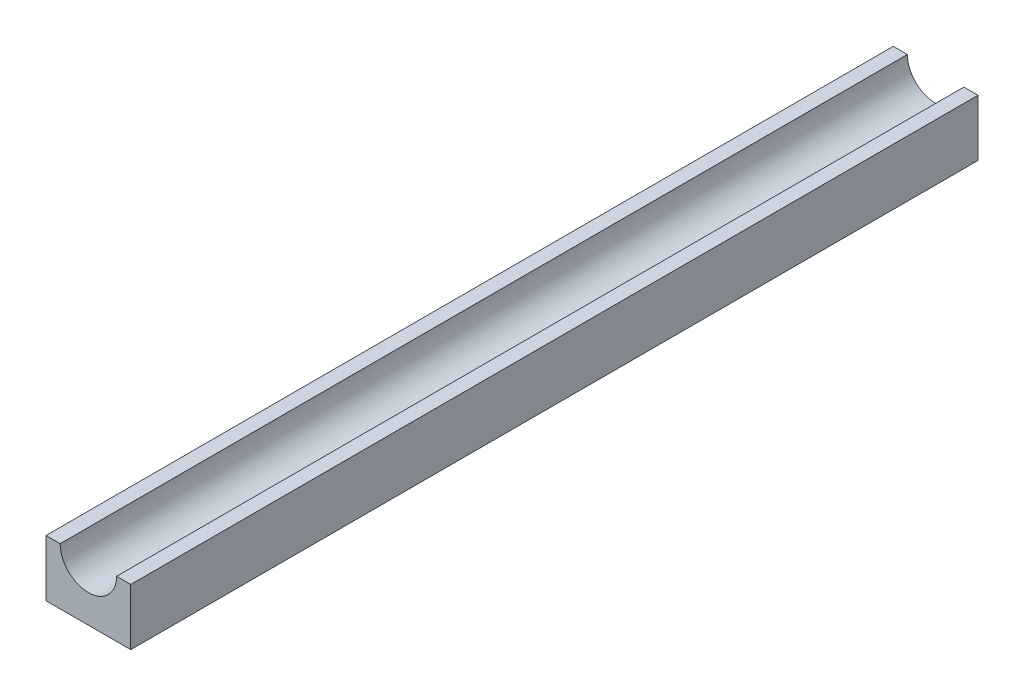
ISO-10303-21;
HEADER;
FILE_DESCRIPTION(('STEP AP214'),'2;1');
FILE_NAME('part.step','',(''),(''),'','','');
FILE_SCHEMA(('AUTOMOTIVE_DESIGN { 1 0 10303 214 1 1 1 1 }'));
ENDSEC;
DATA;
#1=APPLICATION_CONTEXT('core data for automotive mechanical design processes');
#2=APPLICATION_PROTOCOL_DEFINITION('international standard','automotive_design',2000,#1);
#3=PRODUCT_CONTEXT('',#1,'mechanical');
#4=PRODUCT('Part','Part','',(#3));
#5=PRODUCT_RELATED_PRODUCT_CATEGORY('part','',(#4));
#6=PRODUCT_DEFINITION_FORMATION('','',#4);
#7=PRODUCT_DEFINITION_CONTEXT('part definition',#1,'design');
#8=PRODUCT_DEFINITION('design','',#6,#7);
#9=PRODUCT_DEFINITION_SHAPE('','',#8);
#10=(LENGTH_UNIT() NAMED_UNIT(*) SI_UNIT(.MILLI.,.METRE.));
#11=(NAMED_UNIT(*) PLANE_ANGLE_UNIT() SI_UNIT($,.RADIAN.));
#12=(NAMED_UNIT(*) SI_UNIT($,.STERADIAN.) SOLID_ANGLE_UNIT());
#13=UNCERTAINTY_MEASURE_WITH_UNIT(LENGTH_MEASURE(1.E-05),#10,'distance_accuracy_value','');
#14=(GEOMETRIC_REPRESENTATION_CONTEXT(3) GLOBAL_UNCERTAINTY_ASSIGNED_CONTEXT((#13)) GLOBAL_UNIT_ASSIGNED_CONTEXT((#10,
#11,#12)) REPRESENTATION_CONTEXT('',''));
#15=CARTESIAN_POINT('',(0.,0.,0.));
#16=DIRECTION('',(0.,0.,1.));
#17=DIRECTION('',(1.,0.,0.));
#18=AXIS2_PLACEMENT_3D('',#15,#16,#17);
#19=CARTESIAN_POINT('',(0.,5.,150.));
#20=DIRECTION('',(0.,0.,-1.));
#21=DIRECTION('',(-1.,0.,0.));
#22=AXIS2_PLACEMENT_3D('',#19,#20,#21);
#23=CYLINDRICAL_SURFACE('',#22,5.);
#24=CARTESIAN_POINT('',(0.,5.,0.));
#25=DIRECTION('',(0.,0.,1.));
#26=DIRECTION('',(1.,0.,0.));
#27=AXIS2_PLACEMENT_3D('',#24,#25,#26);
#28=CIRCLE('',#27,5.);
#29=CARTESIAN_POINT('',(-5.,5.,0.));
#30=VERTEX_POINT('',#29);
#31=CARTESIAN_POINT('',(5.,5.,0.));
#32=VERTEX_POINT('',#31);
#33=EDGE_CURVE('E207',#30,#32,#28,.T.);
#34=ORIENTED_EDGE('',*,*,#33,.F.);
#35=DIRECTION('',(0.,0.,-1.));
#36=VECTOR('',#35,1.);
#37=CARTESIAN_POINT('',(-5.,5.,150.));
#38=LINE('',#37,#36);
#39=CARTESIAN_POINT('',(-5.,5.,150.));
#40=VERTEX_POINT('',#39);
#41=EDGE_CURVE('E11',#40,#30,#38,.T.);
#42=ORIENTED_EDGE('',*,*,#41,.F.);
#43=CARTESIAN_POINT('',(0.,5.,150.));
#44=DIRECTION('',(0.,0.,1.));
#45=DIRECTION('',(1.,0.,0.));
#46=AXIS2_PLACEMENT_3D('',#43,#44,#45);
#47=CIRCLE('',#46,5.);
#48=CARTESIAN_POINT('',(5.,5.,150.));
#49=VERTEX_POINT('',#48);
#50=EDGE_CURVE('E208',#40,#49,#47,.T.);
#51=ORIENTED_EDGE('',*,*,#50,.T.);
#52=DIRECTION('',(0.,0.,-1.));
#53=VECTOR('',#52,1.);
#54=CARTESIAN_POINT('',(5.,5.,150.));
#55=LINE('',#54,#53);
#56=EDGE_CURVE('E236',#49,#32,#55,.T.);
#57=ORIENTED_EDGE('',*,*,#56,.T.);
#58=EDGE_LOOP('',(#34,#42,#51,#57));
#59=FACE_BOUND('',#58,.T.);
#60=ADVANCED_FACE('F39',(#59),#23,.F.);
#61=CARTESIAN_POINT('',(0.,5.,150.));
#62=DIRECTION('',(0.,1.,0.));
#63=DIRECTION('',(0.,0.,1.));
#64=AXIS2_PLACEMENT_3D('',#61,#62,#63);
#65=PLANE('',#64);
#66=DIRECTION('',(1.,0.,0.));
#67=VECTOR('',#66,1.);
#68=CARTESIAN_POINT('',(0.,5.,0.));
#69=LINE('',#68,#67);
#70=CARTESIAN_POINT('',(-7.5,5.,0.));
#71=VERTEX_POINT('',#70);
#72=EDGE_CURVE('E225',#71,#30,#69,.T.);
#73=ORIENTED_EDGE('',*,*,#72,.F.);
#74=DIRECTION('',(0.,0.,-1.));
#75=VECTOR('',#74,1.);
#76=CARTESIAN_POINT('',(-7.5,5.,150.));
#77=LINE('',#76,#75);
#78=CARTESIAN_POINT('',(-7.5,5.,150.));
#79=VERTEX_POINT('',#78);
#80=EDGE_CURVE('E47',#79,#71,#77,.T.);
#81=ORIENTED_EDGE('',*,*,#80,.F.);
#82=DIRECTION('',(1.,0.,0.));
#83=VECTOR('',#82,1.);
#84=CARTESIAN_POINT('',(0.,5.,150.));
#85=LINE('',#84,#83);
#86=EDGE_CURVE('E211',#79,#40,#85,.T.);
#87=ORIENTED_EDGE('',*,*,#86,.T.);
#88=ORIENTED_EDGE('',*,*,#41,.T.);
#89=EDGE_LOOP('',(#73,#81,#87,#88));
#90=FACE_BOUND('',#89,.T.);
#91=ADVANCED_FACE('F282',(#90),#65,.T.);
#92=CARTESIAN_POINT('',(-7.5,0.,150.));
#93=DIRECTION('',(1.,0.,0.));
#94=DIRECTION('',(0.,1.,0.));
#95=AXIS2_PLACEMENT_3D('',#92,#93,#94);
#96=PLANE('',#95);
#97=DIRECTION('',(0.,-1.,0.));
#98=VECTOR('',#97,1.);
#99=CARTESIAN_POINT('',(-7.5,0.,0.));
#100=LINE('',#99,#98);
#101=CARTESIAN_POINT('',(-7.5,-5.,0.));
#102=VERTEX_POINT('',#101);
#103=EDGE_CURVE('E228',#71,#102,#100,.T.);
#104=ORIENTED_EDGE('',*,*,#103,.T.);
#105=DIRECTION('',(0.,0.,-1.));
#106=VECTOR('',#105,1.);
#107=CARTESIAN_POINT('',(-7.5,-5.,150.));
#108=LINE('',#107,#106);
#109=CARTESIAN_POINT('',(-7.5,-5.,150.));
#110=VERTEX_POINT('',#109);
#111=EDGE_CURVE('E242',#110,#102,#108,.T.);
#112=ORIENTED_EDGE('',*,*,#111,.F.);
#113=DIRECTION('',(0.,-1.,0.));
#114=VECTOR('',#113,1.);
#115=CARTESIAN_POINT('',(-7.5,0.,150.));
#116=LINE('',#115,#114);
#117=EDGE_CURVE('E215',#79,#110,#116,.T.);
#118=ORIENTED_EDGE('',*,*,#117,.F.);
#119=ORIENTED_EDGE('',*,*,#80,.T.);
#120=EDGE_LOOP('',(#104,#112,#118,#119));
#121=FACE_BOUND('',#120,.T.);
#122=ADVANCED_FACE('F287',(#121),#96,.F.);
#123=CARTESIAN_POINT('',(0.,-5.,150.));
#124=DIRECTION('',(0.,1.,0.));
#125=DIRECTION('',(0.,0.,1.));
#126=AXIS2_PLACEMENT_3D('',#123,#124,#125);
#127=PLANE('',#126);
#128=DIRECTION('',(1.,0.,0.));
#129=VECTOR('',#128,1.);
#130=CARTESIAN_POINT('',(-1.49999999999999,-5.00000000000002,12.5));
#131=LINE('',#130,#129);
#132=CARTESIAN_POINT('',(-1.49999999999999,-5.,12.5));
#133=VERTEX_POINT('',#132);
#134=CARTESIAN_POINT('',(1.50000000000001,-5.,12.5));
#135=VERTEX_POINT('',#134);
#136=EDGE_CURVE('E60',#133,#135,#131,.T.);
#137=ORIENTED_EDGE('',*,*,#136,.F.);
#138=DIRECTION('',(0.,0.,-1.));
#139=VECTOR('',#138,1.);
#140=CARTESIAN_POINT('',(-1.5,-5.00000000000001,90.));
#141=LINE('',#140,#139);
#142=CARTESIAN_POINT('',(-1.49999999999999,-5.,17.5));
#143=VERTEX_POINT('',#142);
#144=EDGE_CURVE('E55',#143,#133,#141,.T.);
#145=ORIENTED_EDGE('',*,*,#144,.F.);
#146=DIRECTION('',(1.,0.,0.));
#147=VECTOR('',#146,1.);
#148=CARTESIAN_POINT('',(-1.49999999999999,-5.00000000000002,17.5));
#149=LINE('',#148,#147);
#150=CARTESIAN_POINT('',(1.50000000000001,-5.00000000000002,17.5));
#151=VERTEX_POINT('',#150);
#152=EDGE_CURVE('E173',#143,#151,#149,.T.);
#153=ORIENTED_EDGE('',*,*,#152,.T.);
#154=DIRECTION('',(0.,0.,-1.));
#155=VECTOR('',#154,1.);
#156=CARTESIAN_POINT('',(1.5,-5.00000000000001,90.));
#157=LINE('',#156,#155);
#158=EDGE_CURVE('E165',#151,#135,#157,.T.);
#159=ORIENTED_EDGE('',*,*,#158,.T.);
#160=EDGE_LOOP('',(#137,#145,#153,#159));
#161=FACE_BOUND('',#160,.T.);
#162=DIRECTION('',(1.,0.,0.));
#163=VECTOR('',#162,1.);
#164=CARTESIAN_POINT('',(-1.49999999999999,-5.00000000000002,72.5));
#165=LINE('',#164,#163);
#166=CARTESIAN_POINT('',(-1.49999999999999,-5.,72.5));
#167=VERTEX_POINT('',#166);
#168=CARTESIAN_POINT('',(1.50000000000001,-5.,72.5));
#169=VERTEX_POINT('',#168);
#170=EDGE_CURVE('E187',#167,#169,#165,.T.);
#171=ORIENTED_EDGE('',*,*,#170,.F.);
#172=DIRECTION('',(0.,0.,1.));
#173=VECTOR('',#172,1.);
#174=CARTESIAN_POINT('',(-1.5,-5.00000000000001,0.));
#175=LINE('',#174,#173);
#176=CARTESIAN_POINT('',(-1.49999999999999,-5.,77.5));
#177=VERTEX_POINT('',#176);
#178=EDGE_CURVE('E185',#167,#177,#175,.T.);
#179=ORIENTED_EDGE('',*,*,#178,.T.);
#180=DIRECTION('',(1.,0.,0.));
#181=VECTOR('',#180,1.);
#182=CARTESIAN_POINT('',(-1.49999999999999,-5.00000000000002,77.5));
#183=LINE('',#182,#181);
#184=CARTESIAN_POINT('',(1.50000000000001,-5.00000000000002,77.5));
#185=VERTEX_POINT('',#184);
#186=EDGE_CURVE('E200',#177,#185,#183,.T.);
#187=ORIENTED_EDGE('',*,*,#186,.T.);
#188=DIRECTION('',(0.,0.,1.));
#189=VECTOR('',#188,1.);
#190=CARTESIAN_POINT('',(1.5,-5.00000000000001,0.));
#191=LINE('',#190,#189);
#192=EDGE_CURVE('E180',#169,#185,#191,.T.);
#193=ORIENTED_EDGE('',*,*,#192,.F.);
#194=EDGE_LOOP('',(#171,#179,#187,#193));
#195=FACE_BOUND('',#194,.T.);
#196=DIRECTION('',(1.,0.,0.));
#197=VECTOR('',#196,1.);
#198=CARTESIAN_POINT('',(0.,-5.,0.));
#199=LINE('',#198,#197);
#200=CARTESIAN_POINT('',(7.5,-5.,0.));
#201=VERTEX_POINT('',#200);
#202=EDGE_CURVE('E230',#102,#201,#199,.T.);
#203=ORIENTED_EDGE('',*,*,#202,.T.);
#204=DIRECTION('',(0.,0.,-1.));
#205=VECTOR('',#204,1.);
#206=CARTESIAN_POINT('',(7.5,-5.,150.));
#207=LINE('',#206,#205);
#208=CARTESIAN_POINT('',(7.5,-5.,150.));
#209=VERTEX_POINT('',#208);
#210=EDGE_CURVE('E240',#209,#201,#207,.T.);
#211=ORIENTED_EDGE('',*,*,#210,.F.);
#212=DIRECTION('',(1.,0.,0.));
#213=VECTOR('',#212,1.);
#214=CARTESIAN_POINT('',(0.,-5.,150.));
#215=LINE('',#214,#213);
#216=EDGE_CURVE('E218',#110,#209,#215,.T.);
#217=ORIENTED_EDGE('',*,*,#216,.F.);
#218=ORIENTED_EDGE('',*,*,#111,.T.);
#219=EDGE_LOOP('',(#203,#211,#217,#218));
#220=FACE_BOUND('',#219,.T.);
#221=ADVANCED_FACE('F264',(#161,#195,#220),#127,.F.);
#222=CARTESIAN_POINT('',(7.5,0.,150.));
#223=DIRECTION('',(1.,0.,0.));
#224=DIRECTION('',(0.,1.,0.));
#225=AXIS2_PLACEMENT_3D('',#222,#223,#224);
#226=PLANE('',#225);
#227=DIRECTION('',(0.,-1.,0.));
#228=VECTOR('',#227,1.);
#229=CARTESIAN_POINT('',(7.5,0.,0.));
#230=LINE('',#229,#228);
#231=CARTESIAN_POINT('',(7.5,5.,0.));
#232=VERTEX_POINT('',#231);
#233=EDGE_CURVE('E233',#232,#201,#230,.T.);
#234=ORIENTED_EDGE('',*,*,#233,.F.);
#235=DIRECTION('',(0.,0.,-1.));
#236=VECTOR('',#235,1.);
#237=CARTESIAN_POINT('',(7.5,5.,150.));
#238=LINE('',#237,#236);
#239=CARTESIAN_POINT('',(7.5,5.,150.));
#240=VERTEX_POINT('',#239);
#241=EDGE_CURVE('E238',#240,#232,#238,.T.);
#242=ORIENTED_EDGE('',*,*,#241,.F.);
#243=DIRECTION('',(0.,-1.,0.));
#244=VECTOR('',#243,1.);
#245=CARTESIAN_POINT('',(7.5,0.,150.));
#246=LINE('',#245,#244);
#247=EDGE_CURVE('E220',#240,#209,#246,.T.);
#248=ORIENTED_EDGE('',*,*,#247,.T.);
#249=ORIENTED_EDGE('',*,*,#210,.T.);
#250=EDGE_LOOP('',(#234,#242,#248,#249));
#251=FACE_BOUND('',#250,.T.);
#252=ADVANCED_FACE('F311',(#251),#226,.T.);
#253=EDGE_CURVE('E212',#32,#232,#69,.T.);
#254=ORIENTED_EDGE('',*,*,#253,.F.);
#255=ORIENTED_EDGE('',*,*,#56,.F.);
#256=EDGE_CURVE('E216',#49,#240,#85,.T.);
#257=ORIENTED_EDGE('',*,*,#256,.T.);
#258=ORIENTED_EDGE('',*,*,#241,.T.);
#259=EDGE_LOOP('',(#254,#255,#257,#258));
#260=FACE_BOUND('',#259,.T.);
#261=ADVANCED_FACE('F290',(#260),#65,.T.);
#262=CARTESIAN_POINT('',(0.,0.,150.));
#263=DIRECTION('',(0.,0.,1.));
#264=DIRECTION('',(1.,0.,0.));
#265=AXIS2_PLACEMENT_3D('',#262,#263,#264);
#266=PLANE('',#265);
#267=ORIENTED_EDGE('',*,*,#50,.F.);
#268=ORIENTED_EDGE('',*,*,#86,.F.);
#269=ORIENTED_EDGE('',*,*,#117,.T.);
#270=ORIENTED_EDGE('',*,*,#216,.T.);
#271=ORIENTED_EDGE('',*,*,#247,.F.);
#272=ORIENTED_EDGE('',*,*,#256,.F.);
#273=EDGE_LOOP('',(#267,#268,#269,#270,#271,#272));
#274=FACE_BOUND('',#273,.T.);
#275=ADVANCED_FACE('F303',(#274),#266,.T.);
#276=CARTESIAN_POINT('',(0.,0.,0.));
#277=DIRECTION('',(0.,0.,1.));
#278=DIRECTION('',(1.,0.,0.));
#279=AXIS2_PLACEMENT_3D('',#276,#277,#278);
#280=PLANE('',#279);
#281=ORIENTED_EDGE('',*,*,#33,.T.);
#282=ORIENTED_EDGE('',*,*,#253,.T.);
#283=ORIENTED_EDGE('',*,*,#233,.T.);
#284=ORIENTED_EDGE('',*,*,#202,.F.);
#285=ORIENTED_EDGE('',*,*,#103,.F.);
#286=ORIENTED_EDGE('',*,*,#72,.T.);
#287=EDGE_LOOP('',(#281,#282,#283,#284,#285,#286));
#288=FACE_BOUND('',#287,.T.);
#289=ADVANCED_FACE('F298',(#288),#280,.F.);
#290=CARTESIAN_POINT('',(-1.5,0.,72.5));
#291=DIRECTION('',(0.,0.,1.));
#292=DIRECTION('',(1.,0.,0.));
#293=AXIS2_PLACEMENT_3D('',#290,#291,#292);
#294=PLANE('',#293);
#295=DIRECTION('',(0.,-1.,0.));
#296=VECTOR('',#295,1.);
#297=CARTESIAN_POINT('',(1.5,0.,72.5));
#298=LINE('',#297,#296);
#299=CARTESIAN_POINT('',(1.50000000000001,-8.00000000000001,72.5));
#300=VERTEX_POINT('',#299);
#301=EDGE_CURVE('E175',#169,#300,#298,.T.);
#302=ORIENTED_EDGE('',*,*,#301,.T.);
#303=DIRECTION('',(1.,0.,0.));
#304=VECTOR('',#303,1.);
#305=CARTESIAN_POINT('',(-1.49999999999999,-8.00000000000001,72.5));
#306=LINE('',#305,#304);
#307=CARTESIAN_POINT('',(-1.49999999999999,-8.00000000000001,72.5));
#308=VERTEX_POINT('',#307);
#309=EDGE_CURVE('E204',#308,#300,#306,.T.);
#310=ORIENTED_EDGE('',*,*,#309,.F.);
#311=DIRECTION('',(0.,-1.,0.));
#312=VECTOR('',#311,1.);
#313=CARTESIAN_POINT('',(-1.5,0.,72.5));
#314=LINE('',#313,#312);
#315=EDGE_CURVE('E176',#167,#308,#314,.T.);
#316=ORIENTED_EDGE('',*,*,#315,.F.);
#317=ORIENTED_EDGE('',*,*,#170,.T.);
#318=EDGE_LOOP('',(#302,#310,#316,#317));
#319=FACE_BOUND('',#318,.T.);
#320=ADVANCED_FACE('F327',(#319),#294,.F.);
#321=CARTESIAN_POINT('',(-1.49999999999999,-8.00000000000001,75.));
#322=DIRECTION('',(1.,0.,0.));
#323=DIRECTION('',(0.,1.,0.));
#324=AXIS2_PLACEMENT_3D('',#321,#322,#323);
#325=CYLINDRICAL_SURFACE('',#324,2.50000000000001);
#326=CARTESIAN_POINT('',(1.50000000000001,-8.00000000000001,75.));
#327=DIRECTION('',(-1.,0.,0.));
#328=DIRECTION('',(0.,-1.,0.));
#329=AXIS2_PLACEMENT_3D('',#326,#327,#328);
#330=CIRCLE('',#329,2.50000000000001);
#331=CARTESIAN_POINT('',(1.50000000000001,-8.00000000000001,77.5));
#332=VERTEX_POINT('',#331);
#333=EDGE_CURVE('E190',#300,#332,#330,.T.);
#334=ORIENTED_EDGE('',*,*,#333,.T.);
#335=DIRECTION('',(1.,0.,0.));
#336=VECTOR('',#335,1.);
#337=CARTESIAN_POINT('',(-1.49999999999999,-8.00000000000001,77.5));
#338=LINE('',#337,#336);
#339=CARTESIAN_POINT('',(-1.49999999999999,-8.00000000000001,77.5));
#340=VERTEX_POINT('',#339);
#341=EDGE_CURVE('E202',#340,#332,#338,.T.);
#342=ORIENTED_EDGE('',*,*,#341,.F.);
#343=CARTESIAN_POINT('',(-1.49999999999999,-8.00000000000001,75.));
#344=DIRECTION('',(-1.,0.,0.));
#345=DIRECTION('',(0.,-1.,0.));
#346=AXIS2_PLACEMENT_3D('',#343,#344,#345);
#347=CIRCLE('',#346,2.50000000000001);
#348=EDGE_CURVE('E179',#308,#340,#347,.T.);
#349=ORIENTED_EDGE('',*,*,#348,.F.);
#350=ORIENTED_EDGE('',*,*,#309,.T.);
#351=EDGE_LOOP('',(#334,#342,#349,#350));
#352=FACE_BOUND('',#351,.T.);
#353=ADVANCED_FACE('F332',(#352),#325,.T.);
#354=CARTESIAN_POINT('',(-1.5,0.,77.5));
#355=DIRECTION('',(0.,0.,1.));
#356=DIRECTION('',(1.,0.,0.));
#357=AXIS2_PLACEMENT_3D('',#354,#355,#356);
#358=PLANE('',#357);
#359=DIRECTION('',(0.,-1.,0.));
#360=VECTOR('',#359,1.);
#361=CARTESIAN_POINT('',(1.5,0.,77.5));
#362=LINE('',#361,#360);
#363=EDGE_CURVE('E193',#185,#332,#362,.T.);
#364=ORIENTED_EDGE('',*,*,#363,.F.);
#365=ORIENTED_EDGE('',*,*,#186,.F.);
#366=DIRECTION('',(0.,-1.,0.));
#367=VECTOR('',#366,1.);
#368=CARTESIAN_POINT('',(-1.5,0.,77.5));
#369=LINE('',#368,#367);
#370=EDGE_CURVE('E182',#177,#340,#369,.T.);
#371=ORIENTED_EDGE('',*,*,#370,.T.);
#372=ORIENTED_EDGE('',*,*,#341,.T.);
#373=EDGE_LOOP('',(#364,#365,#371,#372));
#374=FACE_BOUND('',#373,.T.);
#375=ADVANCED_FACE('F336',(#374),#358,.T.);
#376=CARTESIAN_POINT('',(-1.5,0.,0.));
#377=DIRECTION('',(-1.,0.,0.));
#378=DIRECTION('',(0.,-1.,0.));
#379=AXIS2_PLACEMENT_3D('',#376,#377,#378);
#380=PLANE('',#379);
#381=CARTESIAN_POINT('',(-1.49999999999999,-8.00000000000001,75.));
#382=DIRECTION('',(-1.,0.,0.));
#383=DIRECTION('',(0.,-1.,0.));
#384=AXIS2_PLACEMENT_3D('',#381,#382,#383);
#385=CIRCLE('',#384,0.499999999999999);
#386=CARTESIAN_POINT('',(-1.49999999999999,-8.50000000000001,75.));
#387=VERTEX_POINT('',#386);
#388=EDGE_CURVE('E166',#387,#387,#385,.T.);
#389=ORIENTED_EDGE('',*,*,#388,.F.);
#390=EDGE_LOOP('',(#389));
#391=FACE_BOUND('',#390,.T.);
#392=ORIENTED_EDGE('',*,*,#315,.T.);
#393=ORIENTED_EDGE('',*,*,#348,.T.);
#394=ORIENTED_EDGE('',*,*,#370,.F.);
#395=ORIENTED_EDGE('',*,*,#178,.F.);
#396=EDGE_LOOP('',(#392,#393,#394,#395));
#397=FACE_BOUND('',#396,.T.);
#398=ADVANCED_FACE('F340',(#391,#397),#380,.T.);
#399=CARTESIAN_POINT('',(1.5,0.,0.));
#400=DIRECTION('',(-1.,0.,0.));
#401=DIRECTION('',(0.,-1.,0.));
#402=AXIS2_PLACEMENT_3D('',#399,#400,#401);
#403=PLANE('',#402);
#404=CARTESIAN_POINT('',(1.50000000000001,-8.00000000000001,75.));
#405=DIRECTION('',(-1.,0.,0.));
#406=DIRECTION('',(0.,-1.,0.));
#407=AXIS2_PLACEMENT_3D('',#404,#405,#406);
#408=CIRCLE('',#407,0.499999999999999);
#409=CARTESIAN_POINT('',(1.50000000000001,-8.50000000000001,75.));
#410=VERTEX_POINT('',#409);
#411=EDGE_CURVE('E245',#410,#410,#408,.T.);
#412=ORIENTED_EDGE('',*,*,#411,.T.);
#413=EDGE_LOOP('',(#412));
#414=FACE_BOUND('',#413,.T.);
#415=ORIENTED_EDGE('',*,*,#301,.F.);
#416=ORIENTED_EDGE('',*,*,#192,.T.);
#417=ORIENTED_EDGE('',*,*,#363,.T.);
#418=ORIENTED_EDGE('',*,*,#333,.F.);
#419=EDGE_LOOP('',(#415,#416,#417,#418));
#420=FACE_BOUND('',#419,.T.);
#421=ADVANCED_FACE('F342',(#414,#420),#403,.F.);
#422=CARTESIAN_POINT('',(-1.5,0.,17.5));
#423=DIRECTION('',(0.,0.,1.));
#424=DIRECTION('',(1.,0.,0.));
#425=AXIS2_PLACEMENT_3D('',#422,#423,#424);
#426=PLANE('',#425);
#427=DIRECTION('',(0.,-1.,0.));
#428=VECTOR('',#427,1.);
#429=CARTESIAN_POINT('',(1.5,0.,17.5));
#430=LINE('',#429,#428);
#431=CARTESIAN_POINT('',(1.50000000000001,-8.00000000000001,17.5));
#432=VERTEX_POINT('',#431);
#433=EDGE_CURVE('E162',#151,#432,#430,.T.);
#434=ORIENTED_EDGE('',*,*,#433,.F.);
#435=ORIENTED_EDGE('',*,*,#152,.F.);
#436=DIRECTION('',(0.,-1.,0.));
#437=VECTOR('',#436,1.);
#438=CARTESIAN_POINT('',(-1.5,0.,17.5));
#439=LINE('',#438,#437);
#440=CARTESIAN_POINT('',(-1.49999999999999,-8.00000000000001,17.5));
#441=VERTEX_POINT('',#440);
#442=EDGE_CURVE('E170',#143,#441,#439,.T.);
#443=ORIENTED_EDGE('',*,*,#442,.T.);
#444=DIRECTION('',(1.,0.,0.));
#445=VECTOR('',#444,1.);
#446=CARTESIAN_POINT('',(-1.49999999999999,-8.00000000000001,17.5));
#447=LINE('',#446,#445);
#448=EDGE_CURVE('E154',#441,#432,#447,.T.);
#449=ORIENTED_EDGE('',*,*,#448,.T.);
#450=EDGE_LOOP('',(#434,#435,#443,#449));
#451=FACE_BOUND('',#450,.T.);
#452=ADVANCED_FACE('F262',(#451),#426,.T.);
#453=CARTESIAN_POINT('',(-1.5,0.,12.5));
#454=DIRECTION('',(0.,0.,1.));
#455=DIRECTION('',(1.,0.,0.));
#456=AXIS2_PLACEMENT_3D('',#453,#454,#455);
#457=PLANE('',#456);
#458=DIRECTION('',(0.,-1.,0.));
#459=VECTOR('',#458,1.);
#460=CARTESIAN_POINT('',(1.5,0.,12.5));
#461=LINE('',#460,#459);
#462=CARTESIAN_POINT('',(1.50000000000001,-8.00000000000001,12.5));
#463=VERTEX_POINT('',#462);
#464=EDGE_CURVE('E150',#135,#463,#461,.T.);
#465=ORIENTED_EDGE('',*,*,#464,.T.);
#466=DIRECTION('',(1.,0.,0.));
#467=VECTOR('',#466,1.);
#468=CARTESIAN_POINT('',(-1.49999999999999,-8.00000000000001,12.5));
#469=LINE('',#468,#467);
#470=CARTESIAN_POINT('',(-1.49999999999999,-8.00000000000001,12.5));
#471=VERTEX_POINT('',#470);
#472=EDGE_CURVE('E147',#471,#463,#469,.T.);
#473=ORIENTED_EDGE('',*,*,#472,.F.);
#474=DIRECTION('',(0.,-1.,0.));
#475=VECTOR('',#474,1.);
#476=CARTESIAN_POINT('',(-1.5,0.,12.5));
#477=LINE('',#476,#475);
#478=EDGE_CURVE('E138',#133,#471,#477,.T.);
#479=ORIENTED_EDGE('',*,*,#478,.F.);
#480=ORIENTED_EDGE('',*,*,#136,.T.);
#481=EDGE_LOOP('',(#465,#473,#479,#480));
#482=FACE_BOUND('',#481,.T.);
#483=ADVANCED_FACE('F148',(#482),#457,.F.);
#484=CARTESIAN_POINT('',(-1.49999999999999,-8.00000000000001,15.));
#485=DIRECTION('',(1.,0.,0.));
#486=DIRECTION('',(0.,1.,0.));
#487=AXIS2_PLACEMENT_3D('',#484,#485,#486);
#488=CYLINDRICAL_SURFACE('',#487,2.50000000000001);
#489=CARTESIAN_POINT('',(1.50000000000001,-8.00000000000001,15.));
#490=DIRECTION('',(1.,0.,0.));
#491=DIRECTION('',(0.,-1.,0.));
#492=AXIS2_PLACEMENT_3D('',#489,#490,#491);
#493=CIRCLE('',#492,2.50000000000001);
#494=EDGE_CURVE('E169',#432,#463,#493,.T.);
#495=ORIENTED_EDGE('',*,*,#494,.F.);
#496=ORIENTED_EDGE('',*,*,#448,.F.);
#497=CARTESIAN_POINT('',(-1.49999999999999,-8.00000000000001,15.));
#498=DIRECTION('',(1.,0.,0.));
#499=DIRECTION('',(0.,-1.,0.));
#500=AXIS2_PLACEMENT_3D('',#497,#498,#499);
#501=CIRCLE('',#500,2.50000000000001);
#502=EDGE_CURVE('E143',#441,#471,#501,.T.);
#503=ORIENTED_EDGE('',*,*,#502,.T.);
#504=ORIENTED_EDGE('',*,*,#472,.T.);
#505=EDGE_LOOP('',(#495,#496,#503,#504));
#506=FACE_BOUND('',#505,.T.);
#507=ADVANCED_FACE('F156',(#506),#488,.T.);
#508=CARTESIAN_POINT('',(-1.5,0.,90.));
#509=DIRECTION('',(-1.,0.,0.));
#510=DIRECTION('',(0.,-1.,0.));
#511=AXIS2_PLACEMENT_3D('',#508,#509,#510);
#512=PLANE('',#511);
#513=CARTESIAN_POINT('',(-1.5,-8.,15.));
#514=DIRECTION('',(-1.,0.,0.));
#515=DIRECTION('',(0.,-1.,0.));
#516=AXIS2_PLACEMENT_3D('',#513,#514,#515);
#517=CIRCLE('',#516,0.500000000000001);
#518=CARTESIAN_POINT('',(-1.5,-8.5,15.));
#519=VERTEX_POINT('',#518);
#520=EDGE_CURVE('E252',#519,#519,#517,.T.);
#521=ORIENTED_EDGE('',*,*,#520,.F.);
#522=EDGE_LOOP('',(#521));
#523=FACE_BOUND('',#522,.T.);
#524=ORIENTED_EDGE('',*,*,#442,.F.);
#525=ORIENTED_EDGE('',*,*,#144,.T.);
#526=ORIENTED_EDGE('',*,*,#478,.T.);
#527=ORIENTED_EDGE('',*,*,#502,.F.);
#528=EDGE_LOOP('',(#524,#525,#526,#527));
#529=FACE_BOUND('',#528,.T.);
#530=ADVANCED_FACE('F141',(#523,#529),#512,.T.);
#531=CARTESIAN_POINT('',(1.5,0.,90.));
#532=DIRECTION('',(-1.,0.,0.));
#533=DIRECTION('',(0.,-1.,0.));
#534=AXIS2_PLACEMENT_3D('',#531,#532,#533);
#535=PLANE('',#534);
#536=CARTESIAN_POINT('',(1.50000000000001,-8.,15.));
#537=DIRECTION('',(-1.,0.,0.));
#538=DIRECTION('',(0.,-1.,0.));
#539=AXIS2_PLACEMENT_3D('',#536,#537,#538);
#540=CIRCLE('',#539,0.500000000000001);
#541=CARTESIAN_POINT('',(1.50000000000001,-8.5,15.));
#542=VERTEX_POINT('',#541);
#543=EDGE_CURVE('E42',#542,#542,#540,.T.);
#544=ORIENTED_EDGE('',*,*,#543,.T.);
#545=EDGE_LOOP('',(#544));
#546=FACE_BOUND('',#545,.T.);
#547=ORIENTED_EDGE('',*,*,#433,.T.);
#548=ORIENTED_EDGE('',*,*,#494,.T.);
#549=ORIENTED_EDGE('',*,*,#464,.F.);
#550=ORIENTED_EDGE('',*,*,#158,.F.);
#551=EDGE_LOOP('',(#547,#548,#549,#550));
#552=FACE_BOUND('',#551,.T.);
#553=ADVANCED_FACE('F267',(#546,#552),#535,.F.);
#554=CARTESIAN_POINT('',(7.50000000000001,-8.00000000000001,75.));
#555=DIRECTION('',(-1.,0.,0.));
#556=DIRECTION('',(0.,-1.,0.));
#557=AXIS2_PLACEMENT_3D('',#554,#555,#556);
#558=CYLINDRICAL_SURFACE('',#557,0.499999999999999);
#559=ORIENTED_EDGE('',*,*,#388,.T.);
#560=EDGE_LOOP('',(#559));
#561=FACE_BOUND('',#560,.T.);
#562=ORIENTED_EDGE('',*,*,#411,.F.);
#563=EDGE_LOOP('',(#562));
#564=FACE_BOUND('',#563,.T.);
#565=ADVANCED_FACE('F269',(#561,#564),#558,.F.);
#566=CARTESIAN_POINT('',(8.5,-8.,15.));
#567=DIRECTION('',(-1.,0.,0.));
#568=DIRECTION('',(0.,-1.,0.));
#569=AXIS2_PLACEMENT_3D('',#566,#567,#568);
#570=CYLINDRICAL_SURFACE('',#569,0.500000000000001);
#571=ORIENTED_EDGE('',*,*,#520,.T.);
#572=EDGE_LOOP('',(#571));
#573=FACE_BOUND('',#572,.T.);
#574=ORIENTED_EDGE('',*,*,#543,.F.);
#575=EDGE_LOOP('',(#574));
#576=FACE_BOUND('',#575,.T.);
#577=ADVANCED_FACE('F275',(#573,#576),#570,.F.);
#578=CLOSED_SHELL('',(#60,#91,#122,#221,#252,#261,#275,#289,#320,#353,#375,#398,#421,#452,#483,
#507,#530,#553,#565,#577));
#579=MANIFOLD_SOLID_BREP('B2',#578);
#580=ADVANCED_BREP_SHAPE_REPRESENTATION('',(#18,#579),#14);
#581=SHAPE_DEFINITION_REPRESENTATION(#9,#580);
ENDSEC;
END-ISO-10303-21;
